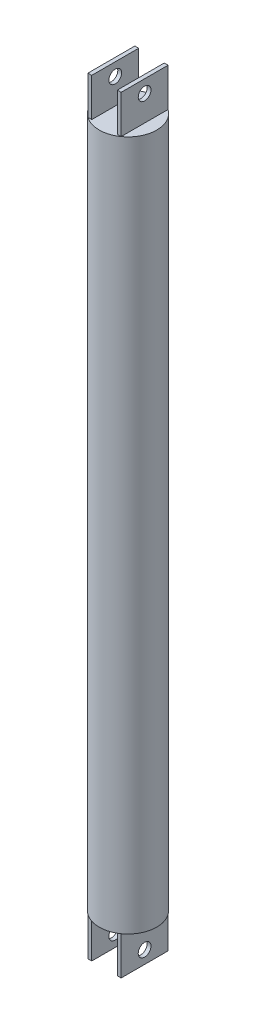
ISO-10303-21;
HEADER;
FILE_DESCRIPTION(('STEP AP214'),'2;1');
FILE_NAME('part.step','',(''),(''),'','','');
FILE_SCHEMA(('AUTOMOTIVE_DESIGN { 1 0 10303 214 1 1 1 1 }'));
ENDSEC;
DATA;
#1=APPLICATION_CONTEXT('core data for automotive mechanical design processes');
#2=APPLICATION_PROTOCOL_DEFINITION('international standard','automotive_design',2000,#1);
#3=PRODUCT_CONTEXT('',#1,'mechanical');
#4=PRODUCT('Part','Part','',(#3));
#5=PRODUCT_RELATED_PRODUCT_CATEGORY('part','',(#4));
#6=PRODUCT_DEFINITION_FORMATION('','',#4);
#7=PRODUCT_DEFINITION_CONTEXT('part definition',#1,'design');
#8=PRODUCT_DEFINITION('design','',#6,#7);
#9=PRODUCT_DEFINITION_SHAPE('','',#8);
#10=(LENGTH_UNIT() NAMED_UNIT(*) SI_UNIT(.MILLI.,.METRE.));
#11=(NAMED_UNIT(*) PLANE_ANGLE_UNIT() SI_UNIT($,.RADIAN.));
#12=(NAMED_UNIT(*) SI_UNIT($,.STERADIAN.) SOLID_ANGLE_UNIT());
#13=UNCERTAINTY_MEASURE_WITH_UNIT(LENGTH_MEASURE(1.E-05),#10,'distance_accuracy_value','');
#14=(GEOMETRIC_REPRESENTATION_CONTEXT(3) GLOBAL_UNCERTAINTY_ASSIGNED_CONTEXT((#13)) GLOBAL_UNIT_ASSIGNED_CONTEXT((#10,
#11,#12)) REPRESENTATION_CONTEXT('',''));
#15=CARTESIAN_POINT('',(0.,0.,0.));
#16=DIRECTION('',(0.,0.,1.));
#17=DIRECTION('',(1.,0.,0.));
#18=AXIS2_PLACEMENT_3D('',#15,#16,#17);
#19=CARTESIAN_POINT('',(0.,520.,0.));
#20=DIRECTION('',(0.,1.,0.));
#21=DIRECTION('',(0.,0.,1.));
#22=AXIS2_PLACEMENT_3D('',#19,#20,#21);
#23=PLANE('',#22);
#24=DIRECTION('',(-1.,0.,0.));
#25=VECTOR('',#24,1.);
#26=CARTESIAN_POINT('',(-10.,520.,-18.364367672207));
#27=LINE('',#26,#25);
#28=CARTESIAN_POINT('',(-10.,520.,-18.364367672207));
#29=VERTEX_POINT('',#28);
#30=CARTESIAN_POINT('',(-13.,520.,-18.364367672207));
#31=VERTEX_POINT('',#30);
#32=EDGE_CURVE('E157',#29,#31,#27,.T.);
#33=ORIENTED_EDGE('',*,*,#32,.F.);
#34=DIRECTION('',(0.,0.,-1.));
#35=VECTOR('',#34,1.);
#36=CARTESIAN_POINT('',(-10.,520.,18.364367672207));
#37=LINE('',#36,#35);
#38=CARTESIAN_POINT('',(-10.,520.,18.364367672207));
#39=VERTEX_POINT('',#38);
#40=EDGE_CURVE('E168',#39,#29,#37,.T.);
#41=ORIENTED_EDGE('',*,*,#40,.F.);
#42=DIRECTION('',(1.,0.,0.));
#43=VECTOR('',#42,1.);
#44=CARTESIAN_POINT('',(-10.,520.,18.364367672207));
#45=LINE('',#44,#43);
#46=CARTESIAN_POINT('',(-13.,520.,18.364367672207));
#47=VERTEX_POINT('',#46);
#48=EDGE_CURVE('E180',#47,#39,#45,.T.);
#49=ORIENTED_EDGE('',*,*,#48,.F.);
#50=CARTESIAN_POINT('',(0.,520.,0.));
#51=DIRECTION('',(0.,1.,0.));
#52=DIRECTION('',(0.,0.,1.));
#53=AXIS2_PLACEMENT_3D('',#50,#51,#52);
#54=CIRCLE('',#53,22.5);
#55=CARTESIAN_POINT('',(13.,520.,18.364367672207));
#56=VERTEX_POINT('',#55);
#57=EDGE_CURVE('E290',#47,#56,#54,.T.);
#58=ORIENTED_EDGE('',*,*,#57,.T.);
#59=DIRECTION('',(1.,0.,0.));
#60=VECTOR('',#59,1.);
#61=CARTESIAN_POINT('',(13.,520.,18.364367672207));
#62=LINE('',#61,#60);
#63=CARTESIAN_POINT('',(10.,520.,18.364367672207));
#64=VERTEX_POINT('',#63);
#65=EDGE_CURVE('E62',#64,#56,#62,.T.);
#66=ORIENTED_EDGE('',*,*,#65,.F.);
#67=DIRECTION('',(0.,0.,1.));
#68=VECTOR('',#67,1.);
#69=CARTESIAN_POINT('',(10.,520.,18.364367672207));
#70=LINE('',#69,#68);
#71=CARTESIAN_POINT('',(10.,520.,-18.364367672207));
#72=VERTEX_POINT('',#71);
#73=EDGE_CURVE('E200',#72,#64,#70,.T.);
#74=ORIENTED_EDGE('',*,*,#73,.F.);
#75=DIRECTION('',(-1.,0.,0.));
#76=VECTOR('',#75,1.);
#77=CARTESIAN_POINT('',(13.,520.,-18.364367672207));
#78=LINE('',#77,#76);
#79=CARTESIAN_POINT('',(13.,520.,-18.364367672207));
#80=VERTEX_POINT('',#79);
#81=EDGE_CURVE('E197',#80,#72,#78,.T.);
#82=ORIENTED_EDGE('',*,*,#81,.F.);
#83=EDGE_CURVE('E177',#80,#31,#54,.T.);
#84=ORIENTED_EDGE('',*,*,#83,.T.);
#85=EDGE_LOOP('',(#33,#41,#49,#58,#66,#74,#82,#84));
#86=FACE_BOUND('',#85,.T.);
#87=ADVANCED_FACE('F36',(#86),#23,.T.);
#88=EDGE_CURVE('E699',#31,#47,#54,.T.);
#89=ORIENTED_EDGE('',*,*,#88,.T.);
#90=DIRECTION('',(0.,0.,1.));
#91=VECTOR('',#90,1.);
#92=CARTESIAN_POINT('',(-13.,520.,18.364367672207));
#93=LINE('',#92,#91);
#94=EDGE_CURVE('E178',#31,#47,#93,.T.);
#95=ORIENTED_EDGE('',*,*,#94,.F.);
#96=EDGE_LOOP('',(#89,#95));
#97=FACE_BOUND('',#96,.T.);
#98=ADVANCED_FACE('F340',(#97),#23,.T.);
#99=DIRECTION('',(0.,0.,-1.));
#100=VECTOR('',#99,1.);
#101=CARTESIAN_POINT('',(13.,520.,18.364367672207));
#102=LINE('',#101,#100);
#103=EDGE_CURVE('E163',#56,#80,#102,.T.);
#104=ORIENTED_EDGE('',*,*,#103,.F.);
#105=EDGE_CURVE('E292',#56,#80,#54,.T.);
#106=ORIENTED_EDGE('',*,*,#105,.T.);
#107=EDGE_LOOP('',(#104,#106));
#108=FACE_BOUND('',#107,.T.);
#109=ADVANCED_FACE('F342',(#108),#23,.T.);
#110=CARTESIAN_POINT('',(0.,-20.,0.));
#111=DIRECTION('',(0.,-1.,0.));
#112=DIRECTION('',(0.,0.,-1.));
#113=AXIS2_PLACEMENT_3D('',#110,#111,#112);
#114=PLANE('',#113);
#115=CARTESIAN_POINT('',(0.,-20.,0.));
#116=DIRECTION('',(0.,-1.,0.));
#117=DIRECTION('',(0.,0.,-1.));
#118=AXIS2_PLACEMENT_3D('',#115,#116,#117);
#119=CIRCLE('',#118,22.5);
#120=CARTESIAN_POINT('',(13.,-20.,-18.364367672207));
#121=VERTEX_POINT('',#120);
#122=CARTESIAN_POINT('',(13.,-20.,18.364367672207));
#123=VERTEX_POINT('',#122);
#124=EDGE_CURVE('E682',#121,#123,#119,.T.);
#125=ORIENTED_EDGE('',*,*,#124,.T.);
#126=DIRECTION('',(0.,0.,1.));
#127=VECTOR('',#126,1.);
#128=CARTESIAN_POINT('',(13.,-20.,18.364367672207));
#129=LINE('',#128,#127);
#130=EDGE_CURVE('E224',#121,#123,#129,.T.);
#131=ORIENTED_EDGE('',*,*,#130,.F.);
#132=EDGE_LOOP('',(#125,#131));
#133=FACE_BOUND('',#132,.T.);
#134=ADVANCED_FACE('F349',(#133),#114,.T.);
#135=DIRECTION('',(0.,0.,-1.));
#136=VECTOR('',#135,1.);
#137=CARTESIAN_POINT('',(10.,-20.,18.364367672207));
#138=LINE('',#137,#136);
#139=CARTESIAN_POINT('',(10.,-20.,18.364367672207));
#140=VERTEX_POINT('',#139);
#141=CARTESIAN_POINT('',(10.,-20.,-18.364367672207));
#142=VERTEX_POINT('',#141);
#143=EDGE_CURVE('E229',#140,#142,#138,.T.);
#144=ORIENTED_EDGE('',*,*,#143,.F.);
#145=DIRECTION('',(-1.,0.,0.));
#146=VECTOR('',#145,1.);
#147=CARTESIAN_POINT('',(13.,-20.,18.364367672207));
#148=LINE('',#147,#146);
#149=EDGE_CURVE('E227',#123,#140,#148,.T.);
#150=ORIENTED_EDGE('',*,*,#149,.F.);
#151=CARTESIAN_POINT('',(-13.,-20.,18.364367672207));
#152=VERTEX_POINT('',#151);
#153=EDGE_CURVE('E286',#123,#152,#119,.T.);
#154=ORIENTED_EDGE('',*,*,#153,.T.);
#155=DIRECTION('',(-1.,0.,0.));
#156=VECTOR('',#155,1.);
#157=CARTESIAN_POINT('',(-13.,-20.,18.364367672207));
#158=LINE('',#157,#156);
#159=CARTESIAN_POINT('',(-10.,-20.,18.364367672207));
#160=VERTEX_POINT('',#159);
#161=EDGE_CURVE('E262',#160,#152,#158,.T.);
#162=ORIENTED_EDGE('',*,*,#161,.F.);
#163=DIRECTION('',(0.,0.,1.));
#164=VECTOR('',#163,1.);
#165=CARTESIAN_POINT('',(-10.,-20.,18.364367672207));
#166=LINE('',#165,#164);
#167=CARTESIAN_POINT('',(-10.,-20.,-18.364367672207));
#168=VERTEX_POINT('',#167);
#169=EDGE_CURVE('E259',#168,#160,#166,.T.);
#170=ORIENTED_EDGE('',*,*,#169,.F.);
#171=DIRECTION('',(1.,0.,0.));
#172=VECTOR('',#171,1.);
#173=CARTESIAN_POINT('',(-13.,-20.,-18.364367672207));
#174=LINE('',#173,#172);
#175=CARTESIAN_POINT('',(-13.,-20.,-18.364367672207));
#176=VERTEX_POINT('',#175);
#177=EDGE_CURVE('E256',#176,#168,#174,.T.);
#178=ORIENTED_EDGE('',*,*,#177,.F.);
#179=EDGE_CURVE('E291',#176,#121,#119,.T.);
#180=ORIENTED_EDGE('',*,*,#179,.T.);
#181=DIRECTION('',(1.,0.,0.));
#182=VECTOR('',#181,1.);
#183=CARTESIAN_POINT('',(13.,-20.,-18.364367672207));
#184=LINE('',#183,#182);
#185=EDGE_CURVE('E232',#142,#121,#184,.T.);
#186=ORIENTED_EDGE('',*,*,#185,.F.);
#187=EDGE_LOOP('',(#144,#150,#154,#162,#170,#178,#180,#186));
#188=FACE_BOUND('',#187,.T.);
#189=ADVANCED_FACE('F354',(#188),#114,.T.);
#190=DIRECTION('',(0.,0.,-1.));
#191=VECTOR('',#190,1.);
#192=CARTESIAN_POINT('',(-13.,-20.,18.364367672207));
#193=LINE('',#192,#191);
#194=EDGE_CURVE('E253',#152,#176,#193,.T.);
#195=ORIENTED_EDGE('',*,*,#194,.F.);
#196=EDGE_CURVE('E287',#152,#176,#119,.T.);
#197=ORIENTED_EDGE('',*,*,#196,.T.);
#198=EDGE_LOOP('',(#195,#197));
#199=FACE_BOUND('',#198,.T.);
#200=ADVANCED_FACE('F357',(#199),#114,.T.);
#201=CARTESIAN_POINT('',(0.,500.,0.));
#202=DIRECTION('',(0.,-1.,0.));
#203=DIRECTION('',(0.,0.,-1.));
#204=AXIS2_PLACEMENT_3D('',#201,#202,#203);
#205=CYLINDRICAL_SURFACE('',#204,22.5);
#206=ORIENTED_EDGE('',*,*,#105,.F.);
#207=ORIENTED_EDGE('',*,*,#57,.F.);
#208=ORIENTED_EDGE('',*,*,#88,.F.);
#209=ORIENTED_EDGE('',*,*,#83,.F.);
#210=EDGE_LOOP('',(#206,#207,#208,#209));
#211=FACE_BOUND('',#210,.T.);
#212=ORIENTED_EDGE('',*,*,#196,.F.);
#213=ORIENTED_EDGE('',*,*,#153,.F.);
#214=ORIENTED_EDGE('',*,*,#124,.F.);
#215=ORIENTED_EDGE('',*,*,#179,.F.);
#216=EDGE_LOOP('',(#212,#213,#214,#215));
#217=FACE_BOUND('',#216,.T.);
#218=ADVANCED_FACE('F38',(#211,#217),#205,.T.);
#219=CARTESIAN_POINT('',(-13.,-50.,18.364367672207));
#220=DIRECTION('',(1.,0.,0.));
#221=DIRECTION('',(0.,0.,-1.));
#222=AXIS2_PLACEMENT_3D('',#219,#220,#221);
#223=PLANE('',#222);
#224=CARTESIAN_POINT('',(-13.,-40.,0.));
#225=DIRECTION('',(1.,0.,0.));
#226=DIRECTION('',(0.,0.,-1.));
#227=AXIS2_PLACEMENT_3D('',#224,#225,#226);
#228=CIRCLE('',#227,5.);
#229=CARTESIAN_POINT('',(-13.,-40.,-5.));
#230=VERTEX_POINT('',#229);
#231=EDGE_CURVE('E299',#230,#230,#228,.T.);
#232=ORIENTED_EDGE('',*,*,#231,.T.);
#233=EDGE_LOOP('',(#232));
#234=FACE_BOUND('',#233,.T.);
#235=ORIENTED_EDGE('',*,*,#194,.T.);
#236=DIRECTION('',(0.,1.,0.));
#237=VECTOR('',#236,1.);
#238=CARTESIAN_POINT('',(-13.,-50.,-18.364367672207));
#239=LINE('',#238,#237);
#240=CARTESIAN_POINT('',(-13.,-50.,-18.364367672207));
#241=VERTEX_POINT('',#240);
#242=EDGE_CURVE('E283',#241,#176,#239,.T.);
#243=ORIENTED_EDGE('',*,*,#242,.F.);
#244=DIRECTION('',(0.,0.,-1.));
#245=VECTOR('',#244,1.);
#246=CARTESIAN_POINT('',(-13.,-50.,18.364367672207));
#247=LINE('',#246,#245);
#248=CARTESIAN_POINT('',(-13.,-50.,18.364367672207));
#249=VERTEX_POINT('',#248);
#250=EDGE_CURVE('E265',#249,#241,#247,.T.);
#251=ORIENTED_EDGE('',*,*,#250,.F.);
#252=DIRECTION('',(0.,1.,0.));
#253=VECTOR('',#252,1.);
#254=CARTESIAN_POINT('',(-13.,-50.,18.364367672207));
#255=LINE('',#254,#253);
#256=EDGE_CURVE('E274',#249,#152,#255,.T.);
#257=ORIENTED_EDGE('',*,*,#256,.T.);
#258=EDGE_LOOP('',(#235,#243,#251,#257));
#259=FACE_BOUND('',#258,.T.);
#260=ADVANCED_FACE('F426',(#234,#259),#223,.F.);
#261=CARTESIAN_POINT('',(-13.,-50.,-18.364367672207));
#262=DIRECTION('',(0.,0.,1.));
#263=DIRECTION('',(1.,0.,0.));
#264=AXIS2_PLACEMENT_3D('',#261,#262,#263);
#265=PLANE('',#264);
#266=ORIENTED_EDGE('',*,*,#177,.T.);
#267=DIRECTION('',(0.,1.,0.));
#268=VECTOR('',#267,1.);
#269=CARTESIAN_POINT('',(-10.,-50.,-18.364367672207));
#270=LINE('',#269,#268);
#271=CARTESIAN_POINT('',(-10.,-50.,-18.364367672207));
#272=VERTEX_POINT('',#271);
#273=EDGE_CURVE('E280',#272,#168,#270,.T.);
#274=ORIENTED_EDGE('',*,*,#273,.F.);
#275=DIRECTION('',(1.,0.,0.));
#276=VECTOR('',#275,1.);
#277=CARTESIAN_POINT('',(-13.,-50.,-18.364367672207));
#278=LINE('',#277,#276);
#279=EDGE_CURVE('E268',#241,#272,#278,.T.);
#280=ORIENTED_EDGE('',*,*,#279,.F.);
#281=ORIENTED_EDGE('',*,*,#242,.T.);
#282=EDGE_LOOP('',(#266,#274,#280,#281));
#283=FACE_BOUND('',#282,.T.);
#284=ADVANCED_FACE('F422',(#283),#265,.F.);
#285=CARTESIAN_POINT('',(-10.,-50.,18.364367672207));
#286=DIRECTION('',(-1.,0.,0.));
#287=DIRECTION('',(0.,0.,1.));
#288=AXIS2_PLACEMENT_3D('',#285,#286,#287);
#289=PLANE('',#288);
#290=CARTESIAN_POINT('',(-10.,-40.,0.));
#291=DIRECTION('',(-1.,0.,0.));
#292=DIRECTION('',(0.,0.,1.));
#293=AXIS2_PLACEMENT_3D('',#290,#291,#292);
#294=CIRCLE('',#293,5.);
#295=CARTESIAN_POINT('',(-10.,-40.,5.));
#296=VERTEX_POINT('',#295);
#297=EDGE_CURVE('E306',#296,#296,#294,.T.);
#298=ORIENTED_EDGE('',*,*,#297,.T.);
#299=EDGE_LOOP('',(#298));
#300=FACE_BOUND('',#299,.T.);
#301=ORIENTED_EDGE('',*,*,#169,.T.);
#302=DIRECTION('',(0.,1.,0.));
#303=VECTOR('',#302,1.);
#304=CARTESIAN_POINT('',(-10.,-50.,18.364367672207));
#305=LINE('',#304,#303);
#306=CARTESIAN_POINT('',(-10.,-50.,18.364367672207));
#307=VERTEX_POINT('',#306);
#308=EDGE_CURVE('E277',#307,#160,#305,.T.);
#309=ORIENTED_EDGE('',*,*,#308,.F.);
#310=DIRECTION('',(0.,0.,1.));
#311=VECTOR('',#310,1.);
#312=CARTESIAN_POINT('',(-10.,-50.,18.364367672207));
#313=LINE('',#312,#311);
#314=EDGE_CURVE('E270',#272,#307,#313,.T.);
#315=ORIENTED_EDGE('',*,*,#314,.F.);
#316=ORIENTED_EDGE('',*,*,#273,.T.);
#317=EDGE_LOOP('',(#301,#309,#315,#316));
#318=FACE_BOUND('',#317,.T.);
#319=ADVANCED_FACE('F418',(#300,#318),#289,.F.);
#320=CARTESIAN_POINT('',(-13.,-50.,18.364367672207));
#321=DIRECTION('',(0.,0.,-1.));
#322=DIRECTION('',(-1.,0.,0.));
#323=AXIS2_PLACEMENT_3D('',#320,#321,#322);
#324=PLANE('',#323);
#325=ORIENTED_EDGE('',*,*,#161,.T.);
#326=ORIENTED_EDGE('',*,*,#256,.F.);
#327=DIRECTION('',(-1.,0.,0.));
#328=VECTOR('',#327,1.);
#329=CARTESIAN_POINT('',(-13.,-50.,18.364367672207));
#330=LINE('',#329,#328);
#331=EDGE_CURVE('E272',#307,#249,#330,.T.);
#332=ORIENTED_EDGE('',*,*,#331,.F.);
#333=ORIENTED_EDGE('',*,*,#308,.T.);
#334=EDGE_LOOP('',(#325,#326,#332,#333));
#335=FACE_BOUND('',#334,.T.);
#336=ADVANCED_FACE('F414',(#335),#324,.F.);
#337=CARTESIAN_POINT('',(-13.,-50.,-18.364367672207));
#338=DIRECTION('',(0.,-1.,0.));
#339=DIRECTION('',(0.,0.,-1.));
#340=AXIS2_PLACEMENT_3D('',#337,#338,#339);
#341=PLANE('',#340);
#342=ORIENTED_EDGE('',*,*,#250,.T.);
#343=ORIENTED_EDGE('',*,*,#279,.T.);
#344=ORIENTED_EDGE('',*,*,#314,.T.);
#345=ORIENTED_EDGE('',*,*,#331,.T.);
#346=EDGE_LOOP('',(#342,#343,#344,#345));
#347=FACE_BOUND('',#346,.T.);
#348=ADVANCED_FACE('F410',(#347),#341,.T.);
#349=CARTESIAN_POINT('',(13.,-50.,18.364367672207));
#350=DIRECTION('',(-1.,0.,0.));
#351=DIRECTION('',(0.,0.,1.));
#352=AXIS2_PLACEMENT_3D('',#349,#350,#351);
#353=PLANE('',#352);
#354=CARTESIAN_POINT('',(13.,-40.,0.));
#355=DIRECTION('',(-1.,0.,0.));
#356=DIRECTION('',(0.,0.,1.));
#357=AXIS2_PLACEMENT_3D('',#354,#355,#356);
#358=CIRCLE('',#357,5.);
#359=CARTESIAN_POINT('',(13.,-40.,5.));
#360=VERTEX_POINT('',#359);
#361=EDGE_CURVE('E311',#360,#360,#358,.T.);
#362=ORIENTED_EDGE('',*,*,#361,.T.);
#363=EDGE_LOOP('',(#362));
#364=FACE_BOUND('',#363,.T.);
#365=ORIENTED_EDGE('',*,*,#130,.T.);
#366=DIRECTION('',(0.,1.,0.));
#367=VECTOR('',#366,1.);
#368=CARTESIAN_POINT('',(13.,-50.,18.364367672207));
#369=LINE('',#368,#367);
#370=CARTESIAN_POINT('',(13.,-50.,18.364367672207));
#371=VERTEX_POINT('',#370);
#372=EDGE_CURVE('E251',#371,#123,#369,.T.);
#373=ORIENTED_EDGE('',*,*,#372,.F.);
#374=DIRECTION('',(0.,0.,1.));
#375=VECTOR('',#374,1.);
#376=CARTESIAN_POINT('',(13.,-50.,18.364367672207));
#377=LINE('',#376,#375);
#378=CARTESIAN_POINT('',(13.,-50.,-18.364367672207));
#379=VERTEX_POINT('',#378);
#380=EDGE_CURVE('E234',#379,#371,#377,.T.);
#381=ORIENTED_EDGE('',*,*,#380,.F.);
#382=DIRECTION('',(0.,1.,0.));
#383=VECTOR('',#382,1.);
#384=CARTESIAN_POINT('',(13.,-50.,-18.364367672207));
#385=LINE('',#384,#383);
#386=EDGE_CURVE('E243',#379,#121,#385,.T.);
#387=ORIENTED_EDGE('',*,*,#386,.T.);
#388=EDGE_LOOP('',(#365,#373,#381,#387));
#389=FACE_BOUND('',#388,.T.);
#390=ADVANCED_FACE('F406',(#364,#389),#353,.F.);
#391=CARTESIAN_POINT('',(13.,-50.,18.364367672207));
#392=DIRECTION('',(0.,0.,-1.));
#393=DIRECTION('',(-1.,0.,0.));
#394=AXIS2_PLACEMENT_3D('',#391,#392,#393);
#395=PLANE('',#394);
#396=ORIENTED_EDGE('',*,*,#149,.T.);
#397=DIRECTION('',(0.,1.,0.));
#398=VECTOR('',#397,1.);
#399=CARTESIAN_POINT('',(10.,-50.,18.364367672207));
#400=LINE('',#399,#398);
#401=CARTESIAN_POINT('',(10.,-50.,18.364367672207));
#402=VERTEX_POINT('',#401);
#403=EDGE_CURVE('E248',#402,#140,#400,.T.);
#404=ORIENTED_EDGE('',*,*,#403,.F.);
#405=DIRECTION('',(-1.,0.,0.));
#406=VECTOR('',#405,1.);
#407=CARTESIAN_POINT('',(13.,-50.,18.364367672207));
#408=LINE('',#407,#406);
#409=EDGE_CURVE('E237',#371,#402,#408,.T.);
#410=ORIENTED_EDGE('',*,*,#409,.F.);
#411=ORIENTED_EDGE('',*,*,#372,.T.);
#412=EDGE_LOOP('',(#396,#404,#410,#411));
#413=FACE_BOUND('',#412,.T.);
#414=ADVANCED_FACE('F402',(#413),#395,.F.);
#415=CARTESIAN_POINT('',(10.,-50.,18.364367672207));
#416=DIRECTION('',(1.,0.,0.));
#417=DIRECTION('',(0.,0.,-1.));
#418=AXIS2_PLACEMENT_3D('',#415,#416,#417);
#419=PLANE('',#418);
#420=CARTESIAN_POINT('',(10.,-40.,0.));
#421=DIRECTION('',(1.,0.,0.));
#422=DIRECTION('',(0.,0.,-1.));
#423=AXIS2_PLACEMENT_3D('',#420,#421,#422);
#424=CIRCLE('',#423,5.);
#425=CARTESIAN_POINT('',(10.,-40.,-5.));
#426=VERTEX_POINT('',#425);
#427=EDGE_CURVE('E40',#426,#426,#424,.T.);
#428=ORIENTED_EDGE('',*,*,#427,.T.);
#429=EDGE_LOOP('',(#428));
#430=FACE_BOUND('',#429,.T.);
#431=ORIENTED_EDGE('',*,*,#143,.T.);
#432=DIRECTION('',(0.,1.,0.));
#433=VECTOR('',#432,1.);
#434=CARTESIAN_POINT('',(10.,-50.,-18.364367672207));
#435=LINE('',#434,#433);
#436=CARTESIAN_POINT('',(10.,-50.,-18.364367672207));
#437=VERTEX_POINT('',#436);
#438=EDGE_CURVE('E246',#437,#142,#435,.T.);
#439=ORIENTED_EDGE('',*,*,#438,.F.);
#440=DIRECTION('',(0.,0.,-1.));
#441=VECTOR('',#440,1.);
#442=CARTESIAN_POINT('',(10.,-50.,18.364367672207));
#443=LINE('',#442,#441);
#444=EDGE_CURVE('E239',#402,#437,#443,.T.);
#445=ORIENTED_EDGE('',*,*,#444,.F.);
#446=ORIENTED_EDGE('',*,*,#403,.T.);
#447=EDGE_LOOP('',(#431,#439,#445,#446));
#448=FACE_BOUND('',#447,.T.);
#449=ADVANCED_FACE('F398',(#430,#448),#419,.F.);
#450=CARTESIAN_POINT('',(13.,-50.,-18.364367672207));
#451=DIRECTION('',(0.,0.,1.));
#452=DIRECTION('',(1.,0.,0.));
#453=AXIS2_PLACEMENT_3D('',#450,#451,#452);
#454=PLANE('',#453);
#455=ORIENTED_EDGE('',*,*,#185,.T.);
#456=ORIENTED_EDGE('',*,*,#386,.F.);
#457=DIRECTION('',(1.,0.,0.));
#458=VECTOR('',#457,1.);
#459=CARTESIAN_POINT('',(13.,-50.,-18.364367672207));
#460=LINE('',#459,#458);
#461=EDGE_CURVE('E241',#437,#379,#460,.T.);
#462=ORIENTED_EDGE('',*,*,#461,.F.);
#463=ORIENTED_EDGE('',*,*,#438,.T.);
#464=EDGE_LOOP('',(#455,#456,#462,#463));
#465=FACE_BOUND('',#464,.T.);
#466=ADVANCED_FACE('F394',(#465),#454,.F.);
#467=CARTESIAN_POINT('',(13.,-50.,-18.364367672207));
#468=DIRECTION('',(0.,1.,0.));
#469=DIRECTION('',(0.,0.,1.));
#470=AXIS2_PLACEMENT_3D('',#467,#468,#469);
#471=PLANE('',#470);
#472=ORIENTED_EDGE('',*,*,#380,.T.);
#473=ORIENTED_EDGE('',*,*,#409,.T.);
#474=ORIENTED_EDGE('',*,*,#444,.T.);
#475=ORIENTED_EDGE('',*,*,#461,.T.);
#476=EDGE_LOOP('',(#472,#473,#474,#475));
#477=FACE_BOUND('',#476,.T.);
#478=ADVANCED_FACE('F388',(#477),#471,.F.);
#479=CARTESIAN_POINT('',(13.,550.,18.364367672207));
#480=DIRECTION('',(-1.,0.,0.));
#481=DIRECTION('',(0.,0.,1.));
#482=AXIS2_PLACEMENT_3D('',#479,#480,#481);
#483=PLANE('',#482);
#484=CARTESIAN_POINT('',(13.,540.,0.));
#485=DIRECTION('',(-1.,0.,0.));
#486=DIRECTION('',(0.,0.,1.));
#487=AXIS2_PLACEMENT_3D('',#484,#485,#486);
#488=CIRCLE('',#487,5.);
#489=CARTESIAN_POINT('',(13.,540.,5.));
#490=VERTEX_POINT('',#489);
#491=EDGE_CURVE('E173',#490,#490,#488,.T.);
#492=ORIENTED_EDGE('',*,*,#491,.T.);
#493=EDGE_LOOP('',(#492));
#494=FACE_BOUND('',#493,.T.);
#495=ORIENTED_EDGE('',*,*,#103,.T.);
#496=DIRECTION('',(0.,-1.,0.));
#497=VECTOR('',#496,1.);
#498=CARTESIAN_POINT('',(13.,550.,-18.364367672207));
#499=LINE('',#498,#497);
#500=CARTESIAN_POINT('',(13.,550.,-18.364367672207));
#501=VERTEX_POINT('',#500);
#502=EDGE_CURVE('E221',#501,#80,#499,.T.);
#503=ORIENTED_EDGE('',*,*,#502,.F.);
#504=DIRECTION('',(0.,0.,-1.));
#505=VECTOR('',#504,1.);
#506=CARTESIAN_POINT('',(13.,550.,18.364367672207));
#507=LINE('',#506,#505);
#508=CARTESIAN_POINT('',(13.,550.,18.364367672207));
#509=VERTEX_POINT('',#508);
#510=EDGE_CURVE('E203',#509,#501,#507,.T.);
#511=ORIENTED_EDGE('',*,*,#510,.F.);
#512=DIRECTION('',(0.,-1.,0.));
#513=VECTOR('',#512,1.);
#514=CARTESIAN_POINT('',(13.,550.,18.364367672207));
#515=LINE('',#514,#513);
#516=EDGE_CURVE('E212',#509,#56,#515,.T.);
#517=ORIENTED_EDGE('',*,*,#516,.T.);
#518=EDGE_LOOP('',(#495,#503,#511,#517));
#519=FACE_BOUND('',#518,.T.);
#520=ADVANCED_FACE('F319',(#494,#519),#483,.F.);
#521=CARTESIAN_POINT('',(13.,550.,-18.364367672207));
#522=DIRECTION('',(0.,0.,1.));
#523=DIRECTION('',(1.,0.,0.));
#524=AXIS2_PLACEMENT_3D('',#521,#522,#523);
#525=PLANE('',#524);
#526=ORIENTED_EDGE('',*,*,#81,.T.);
#527=DIRECTION('',(0.,-1.,0.));
#528=VECTOR('',#527,1.);
#529=CARTESIAN_POINT('',(10.,550.,-18.364367672207));
#530=LINE('',#529,#528);
#531=CARTESIAN_POINT('',(10.,550.,-18.364367672207));
#532=VERTEX_POINT('',#531);
#533=EDGE_CURVE('E218',#532,#72,#530,.T.);
#534=ORIENTED_EDGE('',*,*,#533,.F.);
#535=DIRECTION('',(-1.,0.,0.));
#536=VECTOR('',#535,1.);
#537=CARTESIAN_POINT('',(13.,550.,-18.364367672207));
#538=LINE('',#537,#536);
#539=EDGE_CURVE('E206',#501,#532,#538,.T.);
#540=ORIENTED_EDGE('',*,*,#539,.F.);
#541=ORIENTED_EDGE('',*,*,#502,.T.);
#542=EDGE_LOOP('',(#526,#534,#540,#541));
#543=FACE_BOUND('',#542,.T.);
#544=ADVANCED_FACE('F379',(#543),#525,.F.);
#545=CARTESIAN_POINT('',(10.,550.,18.364367672207));
#546=DIRECTION('',(1.,0.,0.));
#547=DIRECTION('',(0.,0.,-1.));
#548=AXIS2_PLACEMENT_3D('',#545,#546,#547);
#549=PLANE('',#548);
#550=CARTESIAN_POINT('',(10.,540.,0.));
#551=DIRECTION('',(1.,0.,0.));
#552=DIRECTION('',(0.,0.,-1.));
#553=AXIS2_PLACEMENT_3D('',#550,#551,#552);
#554=CIRCLE('',#553,5.);
#555=CARTESIAN_POINT('',(10.,540.,-5.));
#556=VERTEX_POINT('',#555);
#557=EDGE_CURVE('E303',#556,#556,#554,.T.);
#558=ORIENTED_EDGE('',*,*,#557,.T.);
#559=EDGE_LOOP('',(#558));
#560=FACE_BOUND('',#559,.T.);
#561=ORIENTED_EDGE('',*,*,#73,.T.);
#562=DIRECTION('',(0.,-1.,0.));
#563=VECTOR('',#562,1.);
#564=CARTESIAN_POINT('',(10.,550.,18.364367672207));
#565=LINE('',#564,#563);
#566=CARTESIAN_POINT('',(10.,550.,18.364367672207));
#567=VERTEX_POINT('',#566);
#568=EDGE_CURVE('E215',#567,#64,#565,.T.);
#569=ORIENTED_EDGE('',*,*,#568,.F.);
#570=DIRECTION('',(0.,0.,1.));
#571=VECTOR('',#570,1.);
#572=CARTESIAN_POINT('',(10.,550.,18.364367672207));
#573=LINE('',#572,#571);
#574=EDGE_CURVE('E208',#532,#567,#573,.T.);
#575=ORIENTED_EDGE('',*,*,#574,.F.);
#576=ORIENTED_EDGE('',*,*,#533,.T.);
#577=EDGE_LOOP('',(#561,#569,#575,#576));
#578=FACE_BOUND('',#577,.T.);
#579=ADVANCED_FACE('F377',(#560,#578),#549,.F.);
#580=CARTESIAN_POINT('',(13.,550.,18.364367672207));
#581=DIRECTION('',(0.,0.,-1.));
#582=DIRECTION('',(-1.,0.,0.));
#583=AXIS2_PLACEMENT_3D('',#580,#581,#582);
#584=PLANE('',#583);
#585=ORIENTED_EDGE('',*,*,#65,.T.);
#586=ORIENTED_EDGE('',*,*,#516,.F.);
#587=DIRECTION('',(1.,0.,0.));
#588=VECTOR('',#587,1.);
#589=CARTESIAN_POINT('',(13.,550.,18.364367672207));
#590=LINE('',#589,#588);
#591=EDGE_CURVE('E210',#567,#509,#590,.T.);
#592=ORIENTED_EDGE('',*,*,#591,.F.);
#593=ORIENTED_EDGE('',*,*,#568,.T.);
#594=EDGE_LOOP('',(#585,#586,#592,#593));
#595=FACE_BOUND('',#594,.T.);
#596=ADVANCED_FACE('F368',(#595),#584,.F.);
#597=CARTESIAN_POINT('',(13.,550.,-18.364367672207));
#598=DIRECTION('',(0.,1.,0.));
#599=DIRECTION('',(0.,0.,1.));
#600=AXIS2_PLACEMENT_3D('',#597,#598,#599);
#601=PLANE('',#600);
#602=ORIENTED_EDGE('',*,*,#510,.T.);
#603=ORIENTED_EDGE('',*,*,#539,.T.);
#604=ORIENTED_EDGE('',*,*,#574,.T.);
#605=ORIENTED_EDGE('',*,*,#591,.T.);
#606=EDGE_LOOP('',(#602,#603,#604,#605));
#607=FACE_BOUND('',#606,.T.);
#608=ADVANCED_FACE('F373',(#607),#601,.T.);
#609=CARTESIAN_POINT('',(-10.,550.,18.364367672207));
#610=DIRECTION('',(-1.,0.,0.));
#611=DIRECTION('',(0.,0.,1.));
#612=AXIS2_PLACEMENT_3D('',#609,#610,#611);
#613=PLANE('',#612);
#614=CARTESIAN_POINT('',(-10.,540.,0.));
#615=DIRECTION('',(-1.,0.,0.));
#616=DIRECTION('',(0.,0.,1.));
#617=AXIS2_PLACEMENT_3D('',#614,#615,#616);
#618=CIRCLE('',#617,5.);
#619=CARTESIAN_POINT('',(-10.,540.,5.));
#620=VERTEX_POINT('',#619);
#621=EDGE_CURVE('E298',#620,#620,#618,.T.);
#622=ORIENTED_EDGE('',*,*,#621,.T.);
#623=EDGE_LOOP('',(#622));
#624=FACE_BOUND('',#623,.T.);
#625=ORIENTED_EDGE('',*,*,#40,.T.);
#626=DIRECTION('',(0.,-1.,0.));
#627=VECTOR('',#626,1.);
#628=CARTESIAN_POINT('',(-10.,550.,-18.364367672207));
#629=LINE('',#628,#627);
#630=CARTESIAN_POINT('',(-10.,550.,-18.364367672207));
#631=VERTEX_POINT('',#630);
#632=EDGE_CURVE('E152',#631,#29,#629,.T.);
#633=ORIENTED_EDGE('',*,*,#632,.F.);
#634=DIRECTION('',(0.,0.,-1.));
#635=VECTOR('',#634,1.);
#636=CARTESIAN_POINT('',(-10.,550.,18.364367672207));
#637=LINE('',#636,#635);
#638=CARTESIAN_POINT('',(-10.,550.,18.364367672207));
#639=VERTEX_POINT('',#638);
#640=EDGE_CURVE('E185',#639,#631,#637,.T.);
#641=ORIENTED_EDGE('',*,*,#640,.F.);
#642=DIRECTION('',(0.,-1.,0.));
#643=VECTOR('',#642,1.);
#644=CARTESIAN_POINT('',(-10.,550.,18.364367672207));
#645=LINE('',#644,#643);
#646=EDGE_CURVE('E171',#639,#39,#645,.T.);
#647=ORIENTED_EDGE('',*,*,#646,.T.);
#648=EDGE_LOOP('',(#625,#633,#641,#647));
#649=FACE_BOUND('',#648,.T.);
#650=ADVANCED_FACE('F169',(#624,#649),#613,.F.);
#651=CARTESIAN_POINT('',(-10.,550.,-18.364367672207));
#652=DIRECTION('',(0.,0.,1.));
#653=DIRECTION('',(1.,0.,0.));
#654=AXIS2_PLACEMENT_3D('',#651,#652,#653);
#655=PLANE('',#654);
#656=ORIENTED_EDGE('',*,*,#32,.T.);
#657=DIRECTION('',(0.,-1.,0.));
#658=VECTOR('',#657,1.);
#659=CARTESIAN_POINT('',(-13.,550.,-18.364367672207));
#660=LINE('',#659,#658);
#661=CARTESIAN_POINT('',(-13.,550.,-18.364367672207));
#662=VERTEX_POINT('',#661);
#663=EDGE_CURVE('E164',#662,#31,#660,.T.);
#664=ORIENTED_EDGE('',*,*,#663,.F.);
#665=DIRECTION('',(-1.,0.,0.));
#666=VECTOR('',#665,1.);
#667=CARTESIAN_POINT('',(-10.,550.,-18.364367672207));
#668=LINE('',#667,#666);
#669=EDGE_CURVE('E159',#631,#662,#668,.T.);
#670=ORIENTED_EDGE('',*,*,#669,.F.);
#671=ORIENTED_EDGE('',*,*,#632,.T.);
#672=EDGE_LOOP('',(#656,#664,#670,#671));
#673=FACE_BOUND('',#672,.T.);
#674=ADVANCED_FACE('F154',(#673),#655,.F.);
#675=CARTESIAN_POINT('',(-13.,550.,18.364367672207));
#676=DIRECTION('',(1.,0.,0.));
#677=DIRECTION('',(0.,0.,-1.));
#678=AXIS2_PLACEMENT_3D('',#675,#676,#677);
#679=PLANE('',#678);
#680=CARTESIAN_POINT('',(-13.,540.,0.));
#681=DIRECTION('',(1.,0.,0.));
#682=DIRECTION('',(0.,0.,-1.));
#683=AXIS2_PLACEMENT_3D('',#680,#681,#682);
#684=CIRCLE('',#683,5.);
#685=CARTESIAN_POINT('',(-13.,540.,-5.));
#686=VERTEX_POINT('',#685);
#687=EDGE_CURVE('E296',#686,#686,#684,.T.);
#688=ORIENTED_EDGE('',*,*,#687,.T.);
#689=EDGE_LOOP('',(#688));
#690=FACE_BOUND('',#689,.T.);
#691=ORIENTED_EDGE('',*,*,#94,.T.);
#692=DIRECTION('',(0.,-1.,0.));
#693=VECTOR('',#692,1.);
#694=CARTESIAN_POINT('',(-13.,550.,18.364367672207));
#695=LINE('',#694,#693);
#696=CARTESIAN_POINT('',(-13.,550.,18.364367672207));
#697=VERTEX_POINT('',#696);
#698=EDGE_CURVE('E54',#697,#47,#695,.T.);
#699=ORIENTED_EDGE('',*,*,#698,.F.);
#700=DIRECTION('',(0.,0.,1.));
#701=VECTOR('',#700,1.);
#702=CARTESIAN_POINT('',(-13.,550.,18.364367672207));
#703=LINE('',#702,#701);
#704=EDGE_CURVE('E188',#662,#697,#703,.T.);
#705=ORIENTED_EDGE('',*,*,#704,.F.);
#706=ORIENTED_EDGE('',*,*,#663,.T.);
#707=EDGE_LOOP('',(#691,#699,#705,#706));
#708=FACE_BOUND('',#707,.T.);
#709=ADVANCED_FACE('F575',(#690,#708),#679,.F.);
#710=CARTESIAN_POINT('',(-10.,550.,18.364367672207));
#711=DIRECTION('',(0.,0.,-1.));
#712=DIRECTION('',(-1.,0.,0.));
#713=AXIS2_PLACEMENT_3D('',#710,#711,#712);
#714=PLANE('',#713);
#715=ORIENTED_EDGE('',*,*,#48,.T.);
#716=ORIENTED_EDGE('',*,*,#646,.F.);
#717=DIRECTION('',(1.,0.,0.));
#718=VECTOR('',#717,1.);
#719=CARTESIAN_POINT('',(-10.,550.,18.364367672207));
#720=LINE('',#719,#718);
#721=EDGE_CURVE('E190',#697,#639,#720,.T.);
#722=ORIENTED_EDGE('',*,*,#721,.F.);
#723=ORIENTED_EDGE('',*,*,#698,.T.);
#724=EDGE_LOOP('',(#715,#716,#722,#723));
#725=FACE_BOUND('',#724,.T.);
#726=ADVANCED_FACE('F582',(#725),#714,.F.);
#727=CARTESIAN_POINT('',(-10.,550.,-18.364367672207));
#728=DIRECTION('',(0.,1.,0.));
#729=DIRECTION('',(0.,0.,1.));
#730=AXIS2_PLACEMENT_3D('',#727,#728,#729);
#731=PLANE('',#730);
#732=ORIENTED_EDGE('',*,*,#640,.T.);
#733=ORIENTED_EDGE('',*,*,#669,.T.);
#734=ORIENTED_EDGE('',*,*,#704,.T.);
#735=ORIENTED_EDGE('',*,*,#721,.T.);
#736=EDGE_LOOP('',(#732,#733,#734,#735));
#737=FACE_BOUND('',#736,.T.);
#738=ADVANCED_FACE('F335',(#737),#731,.T.);
#739=CARTESIAN_POINT('',(22.5,540.,0.));
#740=DIRECTION('',(-1.,0.,0.));
#741=DIRECTION('',(0.,0.,1.));
#742=AXIS2_PLACEMENT_3D('',#739,#740,#741);
#743=CYLINDRICAL_SURFACE('',#742,5.);
#744=ORIENTED_EDGE('',*,*,#687,.F.);
#745=EDGE_LOOP('',(#744));
#746=FACE_BOUND('',#745,.T.);
#747=ORIENTED_EDGE('',*,*,#621,.F.);
#748=EDGE_LOOP('',(#747));
#749=FACE_BOUND('',#748,.T.);
#750=ADVANCED_FACE('F325',(#746,#749),#743,.F.);
#751=ORIENTED_EDGE('',*,*,#557,.F.);
#752=EDGE_LOOP('',(#751));
#753=FACE_BOUND('',#752,.T.);
#754=ORIENTED_EDGE('',*,*,#491,.F.);
#755=EDGE_LOOP('',(#754));
#756=FACE_BOUND('',#755,.T.);
#757=ADVANCED_FACE('F322',(#753,#756),#743,.F.);
#758=CARTESIAN_POINT('',(22.5,-40.,0.));
#759=DIRECTION('',(-1.,0.,0.));
#760=DIRECTION('',(0.,0.,1.));
#761=AXIS2_PLACEMENT_3D('',#758,#759,#760);
#762=CYLINDRICAL_SURFACE('',#761,5.);
#763=ORIENTED_EDGE('',*,*,#427,.F.);
#764=EDGE_LOOP('',(#763));
#765=FACE_BOUND('',#764,.T.);
#766=ORIENTED_EDGE('',*,*,#361,.F.);
#767=EDGE_LOOP('',(#766));
#768=FACE_BOUND('',#767,.T.);
#769=ADVANCED_FACE('F324',(#765,#768),#762,.F.);
#770=ORIENTED_EDGE('',*,*,#297,.F.);
#771=EDGE_LOOP('',(#770));
#772=FACE_BOUND('',#771,.T.);
#773=ORIENTED_EDGE('',*,*,#231,.F.);
#774=EDGE_LOOP('',(#773));
#775=FACE_BOUND('',#774,.T.);
#776=ADVANCED_FACE('F332',(#772,#775),#762,.F.);
#777=CLOSED_SHELL('',(#87,#98,#109,#134,#189,#200,#218,#260,#284,#319,#336,#348,#390,#414,#449,
#466,#478,#520,#544,#579,#596,#608,#650,#674,#709,#726,#738,#750,#757,#769,#776));
#778=CARTESIAN_POINT('',(0.,0.,0.));
#779=DIRECTION('',(0.,-1.,0.));
#780=DIRECTION('',(0.,0.,-1.));
#781=AXIS2_PLACEMENT_3D('',#778,#779,#780);
#782=PLANE('',#781);
#783=CARTESIAN_POINT('',(0.,0.,0.));
#784=DIRECTION('',(0.,1.,0.));
#785=DIRECTION('',(0.,0.,1.));
#786=AXIS2_PLACEMENT_3D('',#783,#784,#785);
#787=CIRCLE('',#786,20.5);
#788=CARTESIAN_POINT('',(0.,0.,20.5));
#789=VERTEX_POINT('',#788);
#790=EDGE_CURVE('E11',#789,#789,#787,.T.);
#791=ORIENTED_EDGE('',*,*,#790,.T.);
#792=EDGE_LOOP('',(#791));
#793=FACE_BOUND('',#792,.T.);
#794=ADVANCED_FACE('F430',(#793),#782,.F.);
#795=CARTESIAN_POINT('',(0.,500.,0.));
#796=DIRECTION('',(0.,1.,0.));
#797=DIRECTION('',(0.,0.,1.));
#798=AXIS2_PLACEMENT_3D('',#795,#796,#797);
#799=PLANE('',#798);
#800=CARTESIAN_POINT('',(0.,500.,0.));
#801=DIRECTION('',(0.,1.,0.));
#802=DIRECTION('',(0.,0.,1.));
#803=AXIS2_PLACEMENT_3D('',#800,#801,#802);
#804=CIRCLE('',#803,20.5);
#805=CARTESIAN_POINT('',(0.,500.,20.5));
#806=VERTEX_POINT('',#805);
#807=EDGE_CURVE('E46',#806,#806,#804,.T.);
#808=ORIENTED_EDGE('',*,*,#807,.F.);
#809=EDGE_LOOP('',(#808));
#810=FACE_BOUND('',#809,.T.);
#811=ADVANCED_FACE('F432',(#810),#799,.F.);
#812=CARTESIAN_POINT('',(0.,500.,0.));
#813=DIRECTION('',(0.,-1.,0.));
#814=DIRECTION('',(0.,0.,-1.));
#815=AXIS2_PLACEMENT_3D('',#812,#813,#814);
#816=CYLINDRICAL_SURFACE('',#815,20.5);
#817=ORIENTED_EDGE('',*,*,#807,.T.);
#818=EDGE_LOOP('',(#817));
#819=FACE_BOUND('',#818,.T.);
#820=ORIENTED_EDGE('',*,*,#790,.F.);
#821=EDGE_LOOP('',(#820));
#822=FACE_BOUND('',#821,.T.);
#823=ADVANCED_FACE('F436',(#819,#822),#816,.F.);
#824=CLOSED_SHELL('',(#794,#811,#823));
#825=ORIENTED_CLOSED_SHELL('',*,#824,.T.);
#826=BREP_WITH_VOIDS('B2',#777,(#825));
#827=ADVANCED_BREP_SHAPE_REPRESENTATION('',(#18,#826),#14);
#828=SHAPE_DEFINITION_REPRESENTATION(#9,#827);
ENDSEC;
END-ISO-10303-21;
